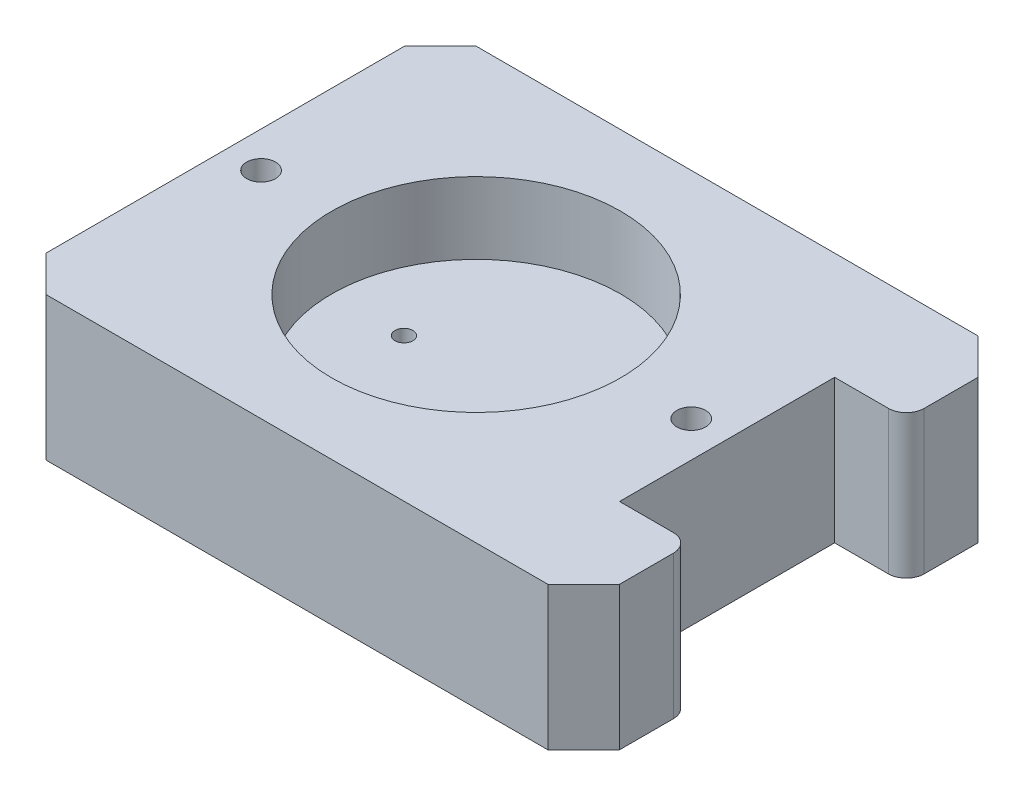
ISO-10303-21;
HEADER;
FILE_DESCRIPTION(('STEP AP214'),'2;1');
FILE_NAME('part.step','',(''),(''),'','','');
FILE_SCHEMA(('AUTOMOTIVE_DESIGN { 1 0 10303 214 1 1 1 1 }'));
ENDSEC;
DATA;
#1=APPLICATION_CONTEXT('core data for automotive mechanical design processes');
#2=APPLICATION_PROTOCOL_DEFINITION('international standard','automotive_design',2000,#1);
#3=PRODUCT_CONTEXT('',#1,'mechanical');
#4=PRODUCT('Part','Part','',(#3));
#5=PRODUCT_RELATED_PRODUCT_CATEGORY('part','',(#4));
#6=PRODUCT_DEFINITION_FORMATION('','',#4);
#7=PRODUCT_DEFINITION_CONTEXT('part definition',#1,'design');
#8=PRODUCT_DEFINITION('design','',#6,#7);
#9=PRODUCT_DEFINITION_SHAPE('','',#8);
#10=(LENGTH_UNIT() NAMED_UNIT(*) SI_UNIT(.MILLI.,.METRE.));
#11=(NAMED_UNIT(*) PLANE_ANGLE_UNIT() SI_UNIT($,.RADIAN.));
#12=(NAMED_UNIT(*) SI_UNIT($,.STERADIAN.) SOLID_ANGLE_UNIT());
#13=UNCERTAINTY_MEASURE_WITH_UNIT(LENGTH_MEASURE(1.E-05),#10,'distance_accuracy_value','');
#14=(GEOMETRIC_REPRESENTATION_CONTEXT(3) GLOBAL_UNCERTAINTY_ASSIGNED_CONTEXT((#13)) GLOBAL_UNIT_ASSIGNED_CONTEXT((#10,
#11,#12)) REPRESENTATION_CONTEXT('',''));
#15=CARTESIAN_POINT('',(0.,0.,0.));
#16=DIRECTION('',(0.,0.,1.));
#17=DIRECTION('',(1.,0.,0.));
#18=AXIS2_PLACEMENT_3D('',#15,#16,#17);
#19=CARTESIAN_POINT('',(50.8,25.4,19.05));
#20=DIRECTION('',(-1.,0.,0.));
#21=DIRECTION('',(0.,0.,1.));
#22=AXIS2_PLACEMENT_3D('',#19,#20,#21);
#23=PLANE('',#22);
#24=DIRECTION('',(0.,0.,-1.));
#25=VECTOR('',#24,1.);
#26=CARTESIAN_POINT('',(50.8,25.4,19.05));
#27=LINE('',#26,#25);
#28=CARTESIAN_POINT('',(50.8,25.4,31.75));
#29=VERTEX_POINT('',#28);
#30=CARTESIAN_POINT('',(50.8,25.4,22.225));
#31=VERTEX_POINT('',#30);
#32=EDGE_CURVE('E205',#29,#31,#27,.T.);
#33=ORIENTED_EDGE('',*,*,#32,.F.);
#34=DIRECTION('',(0.,-1.,0.));
#35=VECTOR('',#34,1.);
#36=CARTESIAN_POINT('',(50.8,25.4,31.75));
#37=LINE('',#36,#35);
#38=CARTESIAN_POINT('',(50.8,0.,31.75));
#39=VERTEX_POINT('',#38);
#40=EDGE_CURVE('E51',#29,#39,#37,.T.);
#41=ORIENTED_EDGE('',*,*,#40,.T.);
#42=DIRECTION('',(0.,0.,-1.));
#43=VECTOR('',#42,1.);
#44=CARTESIAN_POINT('',(50.8,0.,19.05));
#45=LINE('',#44,#43);
#46=CARTESIAN_POINT('',(50.8,0.,22.225));
#47=VERTEX_POINT('',#46);
#48=EDGE_CURVE('E201',#39,#47,#45,.T.);
#49=ORIENTED_EDGE('',*,*,#48,.T.);
#50=DIRECTION('',(0.,-1.,0.));
#51=VECTOR('',#50,1.);
#52=CARTESIAN_POINT('',(50.8,25.4,22.225));
#53=LINE('',#52,#51);
#54=EDGE_CURVE('E270',#47,#31,#53,.F.);
#55=ORIENTED_EDGE('',*,*,#54,.T.);
#56=EDGE_LOOP('',(#33,#41,#49,#55));
#57=FACE_BOUND('',#56,.T.);
#58=ADVANCED_FACE('F42',(#57),#23,.F.);
#59=CARTESIAN_POINT('',(50.8,25.4,19.05));
#60=DIRECTION('',(0.,0.,1.));
#61=DIRECTION('',(1.,0.,0.));
#62=AXIS2_PLACEMENT_3D('',#59,#60,#61);
#63=PLANE('',#62);
#64=DIRECTION('',(-1.,0.,0.));
#65=VECTOR('',#64,1.);
#66=CARTESIAN_POINT('',(50.8,25.4,19.05));
#67=LINE('',#66,#65);
#68=CARTESIAN_POINT('',(47.625,25.4,19.05));
#69=VERTEX_POINT('',#68);
#70=CARTESIAN_POINT('',(38.1,25.4,19.05));
#71=VERTEX_POINT('',#70);
#72=EDGE_CURVE('E207',#69,#71,#67,.T.);
#73=ORIENTED_EDGE('',*,*,#72,.F.);
#74=DIRECTION('',(0.,-1.,0.));
#75=VECTOR('',#74,1.);
#76=CARTESIAN_POINT('',(47.625,25.4,19.05));
#77=LINE('',#76,#75);
#78=CARTESIAN_POINT('',(47.625,0.,19.05));
#79=VERTEX_POINT('',#78);
#80=EDGE_CURVE('E261',#69,#79,#77,.T.);
#81=ORIENTED_EDGE('',*,*,#80,.T.);
#82=DIRECTION('',(-1.,0.,0.));
#83=VECTOR('',#82,1.);
#84=CARTESIAN_POINT('',(50.8,0.,19.05));
#85=LINE('',#84,#83);
#86=CARTESIAN_POINT('',(38.1,0.,19.05));
#87=VERTEX_POINT('',#86);
#88=EDGE_CURVE('E232',#79,#87,#85,.T.);
#89=ORIENTED_EDGE('',*,*,#88,.T.);
#90=DIRECTION('',(0.,-1.,0.));
#91=VECTOR('',#90,1.);
#92=CARTESIAN_POINT('',(38.1,25.4,19.05));
#93=LINE('',#92,#91);
#94=EDGE_CURVE('E257',#71,#87,#93,.T.);
#95=ORIENTED_EDGE('',*,*,#94,.F.);
#96=EDGE_LOOP('',(#73,#81,#89,#95));
#97=FACE_BOUND('',#96,.T.);
#98=ADVANCED_FACE('F341',(#97),#63,.F.);
#99=CARTESIAN_POINT('',(38.1,25.4,-19.05));
#100=DIRECTION('',(-1.,0.,0.));
#101=DIRECTION('',(0.,0.,1.));
#102=AXIS2_PLACEMENT_3D('',#99,#100,#101);
#103=PLANE('',#102);
#104=DIRECTION('',(0.,0.,-1.));
#105=VECTOR('',#104,1.);
#106=CARTESIAN_POINT('',(38.1,0.,-19.05));
#107=LINE('',#106,#105);
#108=CARTESIAN_POINT('',(38.1,0.,-19.05));
#109=VERTEX_POINT('',#108);
#110=EDGE_CURVE('E235',#87,#109,#107,.T.);
#111=ORIENTED_EDGE('',*,*,#110,.T.);
#112=DIRECTION('',(0.,-1.,0.));
#113=VECTOR('',#112,1.);
#114=CARTESIAN_POINT('',(38.1,25.4,-19.05));
#115=LINE('',#114,#113);
#116=CARTESIAN_POINT('',(38.1,25.4,-19.05));
#117=VERTEX_POINT('',#116);
#118=EDGE_CURVE('E229',#117,#109,#115,.T.);
#119=ORIENTED_EDGE('',*,*,#118,.F.);
#120=DIRECTION('',(0.,0.,-1.));
#121=VECTOR('',#120,1.);
#122=CARTESIAN_POINT('',(38.1,25.4,-19.05));
#123=LINE('',#122,#121);
#124=EDGE_CURVE('E210',#71,#117,#123,.T.);
#125=ORIENTED_EDGE('',*,*,#124,.F.);
#126=ORIENTED_EDGE('',*,*,#94,.T.);
#127=EDGE_LOOP('',(#111,#119,#125,#126));
#128=FACE_BOUND('',#127,.T.);
#129=ADVANCED_FACE('F345',(#128),#103,.F.);
#130=CARTESIAN_POINT('',(50.8,25.4,-19.05));
#131=DIRECTION('',(0.,0.,-1.));
#132=DIRECTION('',(-1.,0.,0.));
#133=AXIS2_PLACEMENT_3D('',#130,#131,#132);
#134=PLANE('',#133);
#135=DIRECTION('',(1.,0.,0.));
#136=VECTOR('',#135,1.);
#137=CARTESIAN_POINT('',(50.8,0.,-19.05));
#138=LINE('',#137,#136);
#139=CARTESIAN_POINT('',(47.625,0.,-19.05));
#140=VERTEX_POINT('',#139);
#141=EDGE_CURVE('E238',#109,#140,#138,.T.);
#142=ORIENTED_EDGE('',*,*,#141,.T.);
#143=DIRECTION('',(0.,-1.,0.));
#144=VECTOR('',#143,1.);
#145=CARTESIAN_POINT('',(47.625,25.4,-19.05));
#146=LINE('',#145,#144);
#147=CARTESIAN_POINT('',(47.625,25.4,-19.05));
#148=VERTEX_POINT('',#147);
#149=EDGE_CURVE('E280',#140,#148,#146,.F.);
#150=ORIENTED_EDGE('',*,*,#149,.T.);
#151=DIRECTION('',(1.,0.,0.));
#152=VECTOR('',#151,1.);
#153=CARTESIAN_POINT('',(50.8,25.4,-19.05));
#154=LINE('',#153,#152);
#155=EDGE_CURVE('E212',#117,#148,#154,.T.);
#156=ORIENTED_EDGE('',*,*,#155,.F.);
#157=ORIENTED_EDGE('',*,*,#118,.T.);
#158=EDGE_LOOP('',(#142,#150,#156,#157));
#159=FACE_BOUND('',#158,.T.);
#160=ADVANCED_FACE('F615',(#159),#134,.F.);
#161=CARTESIAN_POINT('',(50.8,25.4,-38.1));
#162=DIRECTION('',(-1.,0.,0.));
#163=DIRECTION('',(0.,0.,1.));
#164=AXIS2_PLACEMENT_3D('',#161,#162,#163);
#165=PLANE('',#164);
#166=DIRECTION('',(0.,0.,-1.));
#167=VECTOR('',#166,1.);
#168=CARTESIAN_POINT('',(50.8,0.,-38.1));
#169=LINE('',#168,#167);
#170=CARTESIAN_POINT('',(50.8,0.,-22.225));
#171=VERTEX_POINT('',#170);
#172=CARTESIAN_POINT('',(50.8,0.,-31.75));
#173=VERTEX_POINT('',#172);
#174=EDGE_CURVE('E241',#171,#173,#169,.T.);
#175=ORIENTED_EDGE('',*,*,#174,.T.);
#176=DIRECTION('',(0.,1.,0.));
#177=VECTOR('',#176,1.);
#178=CARTESIAN_POINT('',(50.8,25.4,-31.75));
#179=LINE('',#178,#177);
#180=CARTESIAN_POINT('',(50.8,25.4,-31.75));
#181=VERTEX_POINT('',#180);
#182=EDGE_CURVE('E11',#173,#181,#179,.T.);
#183=ORIENTED_EDGE('',*,*,#182,.T.);
#184=DIRECTION('',(0.,0.,-1.));
#185=VECTOR('',#184,1.);
#186=CARTESIAN_POINT('',(50.8,25.4,-38.1));
#187=LINE('',#186,#185);
#188=CARTESIAN_POINT('',(50.8,25.4,-22.225));
#189=VERTEX_POINT('',#188);
#190=EDGE_CURVE('E215',#189,#181,#187,.T.);
#191=ORIENTED_EDGE('',*,*,#190,.F.);
#192=DIRECTION('',(0.,-1.,0.));
#193=VECTOR('',#192,1.);
#194=CARTESIAN_POINT('',(50.8,25.4,-22.225));
#195=LINE('',#194,#193);
#196=EDGE_CURVE('E277',#189,#171,#195,.T.);
#197=ORIENTED_EDGE('',*,*,#196,.T.);
#198=EDGE_LOOP('',(#175,#183,#191,#197));
#199=FACE_BOUND('',#198,.T.);
#200=ADVANCED_FACE('F356',(#199),#165,.F.);
#201=CARTESIAN_POINT('',(-50.8,25.4,-38.1));
#202=DIRECTION('',(0.,0.,1.));
#203=DIRECTION('',(1.,0.,0.));
#204=AXIS2_PLACEMENT_3D('',#201,#202,#203);
#205=PLANE('',#204);
#206=DIRECTION('',(-1.,0.,0.));
#207=VECTOR('',#206,1.);
#208=CARTESIAN_POINT('',(-50.8,0.,-38.1));
#209=LINE('',#208,#207);
#210=CARTESIAN_POINT('',(44.45,0.,-38.1));
#211=VERTEX_POINT('',#210);
#212=CARTESIAN_POINT('',(-44.45,0.,-38.1));
#213=VERTEX_POINT('',#212);
#214=EDGE_CURVE('E244',#211,#213,#209,.T.);
#215=ORIENTED_EDGE('',*,*,#214,.T.);
#216=DIRECTION('',(0.,1.,0.));
#217=VECTOR('',#216,1.);
#218=CARTESIAN_POINT('',(-44.45,25.4,-38.1));
#219=LINE('',#218,#217);
#220=CARTESIAN_POINT('',(-44.45,25.4,-38.1));
#221=VERTEX_POINT('',#220);
#222=EDGE_CURVE('E316',#213,#221,#219,.T.);
#223=ORIENTED_EDGE('',*,*,#222,.T.);
#224=DIRECTION('',(-1.,0.,0.));
#225=VECTOR('',#224,1.);
#226=CARTESIAN_POINT('',(-50.8,25.4,-38.1));
#227=LINE('',#226,#225);
#228=CARTESIAN_POINT('',(44.45,25.4,-38.1));
#229=VERTEX_POINT('',#228);
#230=EDGE_CURVE('E218',#229,#221,#227,.T.);
#231=ORIENTED_EDGE('',*,*,#230,.F.);
#232=DIRECTION('',(0.,-1.,0.));
#233=VECTOR('',#232,1.);
#234=CARTESIAN_POINT('',(44.45,25.4,-38.1));
#235=LINE('',#234,#233);
#236=EDGE_CURVE('E313',#229,#211,#235,.T.);
#237=ORIENTED_EDGE('',*,*,#236,.T.);
#238=EDGE_LOOP('',(#215,#223,#231,#237));
#239=FACE_BOUND('',#238,.T.);
#240=ADVANCED_FACE('F365',(#239),#205,.F.);
#241=CARTESIAN_POINT('',(-50.8,25.4,-38.1));
#242=DIRECTION('',(1.,0.,0.));
#243=DIRECTION('',(0.,0.,-1.));
#244=AXIS2_PLACEMENT_3D('',#241,#242,#243);
#245=PLANE('',#244);
#246=CARTESIAN_POINT('',(-50.8,6.35,0.));
#247=DIRECTION('',(-1.,0.,0.));
#248=DIRECTION('',(0.,0.,1.));
#249=AXIS2_PLACEMENT_3D('',#246,#247,#248);
#250=CIRCLE('',#249,3.9679118);
#251=CARTESIAN_POINT('',(-50.8,6.35,3.96791179999996));
#252=VERTEX_POINT('',#251);
#253=EDGE_CURVE('E679',#252,#252,#250,.T.);
#254=ORIENTED_EDGE('',*,*,#253,.F.);
#255=EDGE_LOOP('',(#254));
#256=FACE_BOUND('',#255,.T.);
#257=DIRECTION('',(0.,0.,1.));
#258=VECTOR('',#257,1.);
#259=CARTESIAN_POINT('',(-50.8,0.,-38.1));
#260=LINE('',#259,#258);
#261=CARTESIAN_POINT('',(-50.8,0.,-31.75));
#262=VERTEX_POINT('',#261);
#263=CARTESIAN_POINT('',(-50.8,0.,31.75));
#264=VERTEX_POINT('',#263);
#265=EDGE_CURVE('E248',#262,#264,#260,.T.);
#266=ORIENTED_EDGE('',*,*,#265,.T.);
#267=DIRECTION('',(0.,1.,0.));
#268=VECTOR('',#267,1.);
#269=CARTESIAN_POINT('',(-50.8,25.4,31.75));
#270=LINE('',#269,#268);
#271=CARTESIAN_POINT('',(-50.8,25.4,31.75));
#272=VERTEX_POINT('',#271);
#273=EDGE_CURVE('E302',#264,#272,#270,.T.);
#274=ORIENTED_EDGE('',*,*,#273,.T.);
#275=DIRECTION('',(0.,0.,1.));
#276=VECTOR('',#275,1.);
#277=CARTESIAN_POINT('',(-50.8,25.4,-38.1));
#278=LINE('',#277,#276);
#279=CARTESIAN_POINT('',(-50.8,25.4,-31.75));
#280=VERTEX_POINT('',#279);
#281=EDGE_CURVE('E222',#280,#272,#278,.T.);
#282=ORIENTED_EDGE('',*,*,#281,.F.);
#283=DIRECTION('',(0.,-1.,0.));
#284=VECTOR('',#283,1.);
#285=CARTESIAN_POINT('',(-50.8,25.4,-31.75));
#286=LINE('',#285,#284);
#287=EDGE_CURVE('E299',#280,#262,#286,.T.);
#288=ORIENTED_EDGE('',*,*,#287,.T.);
#289=EDGE_LOOP('',(#266,#274,#282,#288));
#290=FACE_BOUND('',#289,.T.);
#291=ADVANCED_FACE('F374',(#256,#290),#245,.F.);
#292=CARTESIAN_POINT('',(-50.8,25.4,38.1));
#293=DIRECTION('',(0.,0.,-1.));
#294=DIRECTION('',(-1.,0.,0.));
#295=AXIS2_PLACEMENT_3D('',#292,#293,#294);
#296=PLANE('',#295);
#297=DIRECTION('',(1.,0.,0.));
#298=VECTOR('',#297,1.);
#299=CARTESIAN_POINT('',(-50.8,25.4,38.1));
#300=LINE('',#299,#298);
#301=CARTESIAN_POINT('',(-44.45,25.4,38.1));
#302=VERTEX_POINT('',#301);
#303=CARTESIAN_POINT('',(44.45,25.4,38.1));
#304=VERTEX_POINT('',#303);
#305=EDGE_CURVE('E225',#302,#304,#300,.T.);
#306=ORIENTED_EDGE('',*,*,#305,.F.);
#307=DIRECTION('',(0.,-1.,0.));
#308=VECTOR('',#307,1.);
#309=CARTESIAN_POINT('',(-44.45,25.4,38.1));
#310=LINE('',#309,#308);
#311=CARTESIAN_POINT('',(-44.45,0.,38.1));
#312=VERTEX_POINT('',#311);
#313=EDGE_CURVE('E285',#302,#312,#310,.T.);
#314=ORIENTED_EDGE('',*,*,#313,.T.);
#315=DIRECTION('',(1.,0.,0.));
#316=VECTOR('',#315,1.);
#317=CARTESIAN_POINT('',(-50.8,0.,38.1));
#318=LINE('',#317,#316);
#319=CARTESIAN_POINT('',(44.45,0.,38.1));
#320=VERTEX_POINT('',#319);
#321=EDGE_CURVE('E208',#312,#320,#318,.T.);
#322=ORIENTED_EDGE('',*,*,#321,.T.);
#323=DIRECTION('',(0.,1.,0.));
#324=VECTOR('',#323,1.);
#325=CARTESIAN_POINT('',(44.45,25.4,38.1));
#326=LINE('',#325,#324);
#327=EDGE_CURVE('E282',#320,#304,#326,.T.);
#328=ORIENTED_EDGE('',*,*,#327,.T.);
#329=EDGE_LOOP('',(#306,#314,#322,#328));
#330=FACE_BOUND('',#329,.T.);
#331=ADVANCED_FACE('F382',(#330),#296,.F.);
#332=CARTESIAN_POINT('',(0.,25.4,0.));
#333=DIRECTION('',(0.,1.,0.));
#334=DIRECTION('',(0.,0.,1.));
#335=AXIS2_PLACEMENT_3D('',#332,#333,#334);
#336=PLANE('',#335);
#337=CARTESIAN_POINT('',(-44.45,25.4,0.));
#338=DIRECTION('',(0.,1.,0.));
#339=DIRECTION('',(0.,0.,1.));
#340=AXIS2_PLACEMENT_3D('',#337,#338,#339);
#341=CIRCLE('',#340,2.55269999999999);
#342=CARTESIAN_POINT('',(-44.45,25.4,2.55269999999995));
#343=VERTEX_POINT('',#342);
#344=EDGE_CURVE('E183',#343,#343,#341,.T.);
#345=ORIENTED_EDGE('',*,*,#344,.F.);
#346=EDGE_LOOP('',(#345));
#347=FACE_BOUND('',#346,.T.);
#348=CARTESIAN_POINT('',(31.75,25.4,0.));
#349=DIRECTION('',(0.,1.,0.));
#350=DIRECTION('',(0.,0.,1.));
#351=AXIS2_PLACEMENT_3D('',#348,#349,#350);
#352=CIRCLE('',#351,2.55269999999999);
#353=CARTESIAN_POINT('',(31.75,25.4,2.5527));
#354=VERTEX_POINT('',#353);
#355=EDGE_CURVE('E189',#354,#354,#352,.T.);
#356=ORIENTED_EDGE('',*,*,#355,.F.);
#357=EDGE_LOOP('',(#356));
#358=FACE_BOUND('',#357,.T.);
#359=CARTESIAN_POINT('',(-6.35,25.4,0.));
#360=DIRECTION('',(0.,1.,0.));
#361=DIRECTION('',(0.,0.,1.));
#362=AXIS2_PLACEMENT_3D('',#359,#360,#361);
#363=CIRCLE('',#362,25.5905);
#364=CARTESIAN_POINT('',(-6.35,25.4,25.5905));
#365=VERTEX_POINT('',#364);
#366=EDGE_CURVE('E196',#365,#365,#363,.T.);
#367=ORIENTED_EDGE('',*,*,#366,.F.);
#368=EDGE_LOOP('',(#367));
#369=FACE_BOUND('',#368,.T.);
#370=ORIENTED_EDGE('',*,*,#281,.T.);
#371=DIRECTION('',(-0.707106781186546,0.,-0.707106781186549));
#372=VECTOR('',#371,1.);
#373=CARTESIAN_POINT('',(-41.2750000000001,25.4,41.2749999999999));
#374=LINE('',#373,#372);
#375=EDGE_CURVE('E310',#272,#302,#374,.F.);
#376=ORIENTED_EDGE('',*,*,#375,.T.);
#377=ORIENTED_EDGE('',*,*,#305,.T.);
#378=DIRECTION('',(-0.70710678118655,0.,0.707106781186545));
#379=VECTOR('',#378,1.);
#380=CARTESIAN_POINT('',(41.2749999999999,25.4,41.2750000000001));
#381=LINE('',#380,#379);
#382=EDGE_CURVE('E306',#304,#29,#381,.F.);
#383=ORIENTED_EDGE('',*,*,#382,.T.);
#384=ORIENTED_EDGE('',*,*,#32,.T.);
#385=CARTESIAN_POINT('',(47.625,25.4,22.225));
#386=DIRECTION('',(0.,1.,0.));
#387=DIRECTION('',(0.,0.,1.));
#388=AXIS2_PLACEMENT_3D('',#385,#386,#387);
#389=CIRCLE('',#388,3.175);
#390=EDGE_CURVE('E275',#31,#69,#389,.T.);
#391=ORIENTED_EDGE('',*,*,#390,.T.);
#392=ORIENTED_EDGE('',*,*,#72,.T.);
#393=ORIENTED_EDGE('',*,*,#124,.T.);
#394=ORIENTED_EDGE('',*,*,#155,.T.);
#395=CARTESIAN_POINT('',(47.625,25.4,-22.225));
#396=DIRECTION('',(0.,1.,0.));
#397=DIRECTION('',(0.,0.,1.));
#398=AXIS2_PLACEMENT_3D('',#395,#396,#397);
#399=CIRCLE('',#398,3.175);
#400=EDGE_CURVE('E273',#148,#189,#399,.T.);
#401=ORIENTED_EDGE('',*,*,#400,.T.);
#402=ORIENTED_EDGE('',*,*,#190,.T.);
#403=DIRECTION('',(0.707106781186545,0.,0.70710678118655));
#404=VECTOR('',#403,1.);
#405=CARTESIAN_POINT('',(41.2750000000002,25.4,-41.2749999999999));
#406=LINE('',#405,#404);
#407=EDGE_CURVE('E304',#181,#229,#406,.F.);
#408=ORIENTED_EDGE('',*,*,#407,.T.);
#409=ORIENTED_EDGE('',*,*,#230,.T.);
#410=DIRECTION('',(0.70710678118655,0.,-0.707106781186545));
#411=VECTOR('',#410,1.);
#412=CARTESIAN_POINT('',(-41.2749999999999,25.4,-41.2750000000001));
#413=LINE('',#412,#411);
#414=EDGE_CURVE('E308',#221,#280,#413,.F.);
#415=ORIENTED_EDGE('',*,*,#414,.T.);
#416=EDGE_LOOP('',(#370,#376,#377,#383,#384,#391,#392,#393,#394,#401,#402,#408,#409,#415));
#417=FACE_BOUND('',#416,.T.);
#418=ADVANCED_FACE('F338',(#347,#358,#369,#417),#336,.T.);
#419=CARTESIAN_POINT('',(0.,0.,0.));
#420=DIRECTION('',(0.,1.,0.));
#421=DIRECTION('',(0.,0.,1.));
#422=AXIS2_PLACEMENT_3D('',#419,#420,#421);
#423=PLANE('',#422);
#424=ORIENTED_EDGE('',*,*,#321,.F.);
#425=DIRECTION('',(0.707106781186546,0.,0.707106781186549));
#426=VECTOR('',#425,1.);
#427=CARTESIAN_POINT('',(-44.45,0.,38.1));
#428=LINE('',#427,#426);
#429=EDGE_CURVE('E296',#312,#264,#428,.F.);
#430=ORIENTED_EDGE('',*,*,#429,.T.);
#431=ORIENTED_EDGE('',*,*,#265,.F.);
#432=DIRECTION('',(-0.70710678118655,0.,0.707106781186545));
#433=VECTOR('',#432,1.);
#434=CARTESIAN_POINT('',(-50.8,0.,-31.75));
#435=LINE('',#434,#433);
#436=EDGE_CURVE('E294',#262,#213,#435,.F.);
#437=ORIENTED_EDGE('',*,*,#436,.T.);
#438=ORIENTED_EDGE('',*,*,#214,.F.);
#439=DIRECTION('',(-0.707106781186545,0.,-0.70710678118655));
#440=VECTOR('',#439,1.);
#441=CARTESIAN_POINT('',(44.45,0.,-38.1));
#442=LINE('',#441,#440);
#443=EDGE_CURVE('E289',#211,#173,#442,.F.);
#444=ORIENTED_EDGE('',*,*,#443,.T.);
#445=ORIENTED_EDGE('',*,*,#174,.F.);
#446=CARTESIAN_POINT('',(47.625,0.,-22.225));
#447=DIRECTION('',(0.,1.,0.));
#448=DIRECTION('',(0.,0.,1.));
#449=AXIS2_PLACEMENT_3D('',#446,#447,#448);
#450=CIRCLE('',#449,3.175);
#451=EDGE_CURVE('E265',#171,#140,#450,.F.);
#452=ORIENTED_EDGE('',*,*,#451,.T.);
#453=ORIENTED_EDGE('',*,*,#141,.F.);
#454=ORIENTED_EDGE('',*,*,#110,.F.);
#455=ORIENTED_EDGE('',*,*,#88,.F.);
#456=CARTESIAN_POINT('',(47.625,0.,22.225));
#457=DIRECTION('',(0.,1.,0.));
#458=DIRECTION('',(0.,0.,1.));
#459=AXIS2_PLACEMENT_3D('',#456,#457,#458);
#460=CIRCLE('',#459,3.175);
#461=EDGE_CURVE('E267',#79,#47,#460,.F.);
#462=ORIENTED_EDGE('',*,*,#461,.T.);
#463=ORIENTED_EDGE('',*,*,#48,.F.);
#464=DIRECTION('',(0.70710678118655,0.,-0.707106781186545));
#465=VECTOR('',#464,1.);
#466=CARTESIAN_POINT('',(50.8,0.,31.75));
#467=LINE('',#466,#465);
#468=EDGE_CURVE('E291',#39,#320,#467,.F.);
#469=ORIENTED_EDGE('',*,*,#468,.T.);
#470=EDGE_LOOP('',(#424,#430,#431,#437,#438,#444,#445,#452,#453,#454,#455,#462,#463,#469));
#471=FACE_BOUND('',#470,.T.);
#472=ADVANCED_FACE('F328',(#471),#423,.F.);
#473=CARTESIAN_POINT('',(-6.35,12.7,0.));
#474=DIRECTION('',(0.,1.,0.));
#475=DIRECTION('',(0.,0.,1.));
#476=AXIS2_PLACEMENT_3D('',#473,#474,#475);
#477=CYLINDRICAL_SURFACE('',#476,25.5905);
#478=CARTESIAN_POINT('',(-6.35,12.7,0.));
#479=DIRECTION('',(0.,1.,0.));
#480=DIRECTION('',(0.,0.,1.));
#481=AXIS2_PLACEMENT_3D('',#478,#479,#480);
#482=CIRCLE('',#481,25.5905);
#483=CARTESIAN_POINT('',(-6.35,12.7,25.5905));
#484=VERTEX_POINT('',#483);
#485=EDGE_CURVE('E197',#484,#484,#482,.T.);
#486=ORIENTED_EDGE('',*,*,#485,.F.);
#487=EDGE_LOOP('',(#486));
#488=FACE_BOUND('',#487,.T.);
#489=ORIENTED_EDGE('',*,*,#366,.T.);
#490=EDGE_LOOP('',(#489));
#491=FACE_BOUND('',#490,.T.);
#492=ADVANCED_FACE('F507',(#488,#491),#477,.F.);
#493=CARTESIAN_POINT('',(-6.35,12.7,0.));
#494=DIRECTION('',(0.,1.,0.));
#495=DIRECTION('',(0.,0.,1.));
#496=AXIS2_PLACEMENT_3D('',#493,#494,#495);
#497=PLANE('',#496);
#498=CARTESIAN_POINT('',(-19.14525,12.7,0.));
#499=DIRECTION('',(0.,1.,0.));
#500=DIRECTION('',(0.,0.,1.));
#501=AXIS2_PLACEMENT_3D('',#498,#499,#500);
#502=CIRCLE('',#501,1.5875);
#503=CARTESIAN_POINT('',(-19.14525,12.7,1.5875));
#504=VERTEX_POINT('',#503);
#505=EDGE_CURVE('E170',#504,#504,#502,.T.);
#506=ORIENTED_EDGE('',*,*,#505,.F.);
#507=EDGE_LOOP('',(#506));
#508=FACE_BOUND('',#507,.T.);
#509=CARTESIAN_POINT('',(6.44525000000001,12.7,0.));
#510=DIRECTION('',(0.,1.,0.));
#511=DIRECTION('',(0.,0.,1.));
#512=AXIS2_PLACEMENT_3D('',#509,#510,#511);
#513=CIRCLE('',#512,1.5875);
#514=CARTESIAN_POINT('',(6.44525000000001,12.7,1.5875));
#515=VERTEX_POINT('',#514);
#516=EDGE_CURVE('E176',#515,#515,#513,.T.);
#517=ORIENTED_EDGE('',*,*,#516,.F.);
#518=EDGE_LOOP('',(#517));
#519=FACE_BOUND('',#518,.T.);
#520=ORIENTED_EDGE('',*,*,#485,.T.);
#521=EDGE_LOOP('',(#520));
#522=FACE_BOUND('',#521,.T.);
#523=ADVANCED_FACE('F402',(#508,#519,#522),#497,.T.);
#524=CARTESIAN_POINT('',(47.625,25.4,22.225));
#525=DIRECTION('',(0.,-1.,0.));
#526=DIRECTION('',(0.,0.,-1.));
#527=AXIS2_PLACEMENT_3D('',#524,#525,#526);
#528=CYLINDRICAL_SURFACE('',#527,3.175);
#529=ORIENTED_EDGE('',*,*,#390,.F.);
#530=ORIENTED_EDGE('',*,*,#54,.F.);
#531=ORIENTED_EDGE('',*,*,#461,.F.);
#532=ORIENTED_EDGE('',*,*,#80,.F.);
#533=EDGE_LOOP('',(#529,#530,#531,#532));
#534=FACE_BOUND('',#533,.T.);
#535=ADVANCED_FACE('F335',(#534),#528,.T.);
#536=CARTESIAN_POINT('',(47.625,25.4,-22.225));
#537=DIRECTION('',(0.,-1.,0.));
#538=DIRECTION('',(0.,0.,-1.));
#539=AXIS2_PLACEMENT_3D('',#536,#537,#538);
#540=CYLINDRICAL_SURFACE('',#539,3.175);
#541=ORIENTED_EDGE('',*,*,#400,.F.);
#542=ORIENTED_EDGE('',*,*,#149,.F.);
#543=ORIENTED_EDGE('',*,*,#451,.F.);
#544=ORIENTED_EDGE('',*,*,#196,.F.);
#545=EDGE_LOOP('',(#541,#542,#543,#544));
#546=FACE_BOUND('',#545,.T.);
#547=ADVANCED_FACE('F353',(#546),#540,.T.);
#548=CARTESIAN_POINT('',(-44.45,25.4,38.1));
#549=DIRECTION('',(0.707106781186549,0.,-0.707106781186546));
#550=DIRECTION('',(0.,-1.,0.));
#551=AXIS2_PLACEMENT_3D('',#548,#549,#550);
#552=PLANE('',#551);
#553=ORIENTED_EDGE('',*,*,#375,.F.);
#554=ORIENTED_EDGE('',*,*,#273,.F.);
#555=ORIENTED_EDGE('',*,*,#429,.F.);
#556=ORIENTED_EDGE('',*,*,#313,.F.);
#557=EDGE_LOOP('',(#553,#554,#555,#556));
#558=FACE_BOUND('',#557,.T.);
#559=ADVANCED_FACE('F379',(#558),#552,.F.);
#560=CARTESIAN_POINT('',(-50.8,25.4,-31.75));
#561=DIRECTION('',(0.707106781186545,0.,0.70710678118655));
#562=DIRECTION('',(0.,-1.,0.));
#563=AXIS2_PLACEMENT_3D('',#560,#561,#562);
#564=PLANE('',#563);
#565=ORIENTED_EDGE('',*,*,#414,.F.);
#566=ORIENTED_EDGE('',*,*,#222,.F.);
#567=ORIENTED_EDGE('',*,*,#436,.F.);
#568=ORIENTED_EDGE('',*,*,#287,.F.);
#569=EDGE_LOOP('',(#565,#566,#567,#568));
#570=FACE_BOUND('',#569,.T.);
#571=ADVANCED_FACE('F371',(#570),#564,.F.);
#572=CARTESIAN_POINT('',(50.8,25.4,31.75));
#573=DIRECTION('',(-0.707106781186545,0.,-0.70710678118655));
#574=DIRECTION('',(0.,-1.,0.));
#575=AXIS2_PLACEMENT_3D('',#572,#573,#574);
#576=PLANE('',#575);
#577=ORIENTED_EDGE('',*,*,#382,.F.);
#578=ORIENTED_EDGE('',*,*,#327,.F.);
#579=ORIENTED_EDGE('',*,*,#468,.F.);
#580=ORIENTED_EDGE('',*,*,#40,.F.);
#581=EDGE_LOOP('',(#577,#578,#579,#580));
#582=FACE_BOUND('',#581,.T.);
#583=ADVANCED_FACE('F384',(#582),#576,.F.);
#584=CARTESIAN_POINT('',(44.45,25.4,-38.1));
#585=DIRECTION('',(-0.70710678118655,0.,0.707106781186545));
#586=DIRECTION('',(0.,-1.,0.));
#587=AXIS2_PLACEMENT_3D('',#584,#585,#586);
#588=PLANE('',#587);
#589=ORIENTED_EDGE('',*,*,#407,.F.);
#590=ORIENTED_EDGE('',*,*,#182,.F.);
#591=ORIENTED_EDGE('',*,*,#443,.F.);
#592=ORIENTED_EDGE('',*,*,#236,.F.);
#593=EDGE_LOOP('',(#589,#590,#591,#592));
#594=FACE_BOUND('',#593,.T.);
#595=ADVANCED_FACE('F44',(#594),#588,.F.);
#596=CARTESIAN_POINT('',(31.75,12.7,0.));
#597=DIRECTION('',(0.,1.,0.));
#598=DIRECTION('',(0.,0.,1.));
#599=AXIS2_PLACEMENT_3D('',#596,#597,#598);
#600=CONICAL_SURFACE('',#599,2.5527,1.02974425867665);
#601=CARTESIAN_POINT('',(31.75,11.1661830978083,0.));
#602=VERTEX_POINT('',#601);
#603=VERTEX_LOOP('',#602);
#604=FACE_BOUND('',#603,.T.);
#605=CARTESIAN_POINT('',(31.75,12.7,0.));
#606=DIRECTION('',(0.,1.,0.));
#607=DIRECTION('',(0.,0.,1.));
#608=AXIS2_PLACEMENT_3D('',#605,#606,#607);
#609=CIRCLE('',#608,2.5527);
#610=CARTESIAN_POINT('',(31.75,12.7,2.55270000000001));
#611=VERTEX_POINT('',#610);
#612=EDGE_CURVE('E192',#611,#611,#609,.T.);
#613=ORIENTED_EDGE('',*,*,#612,.T.);
#614=EDGE_LOOP('',(#613));
#615=FACE_BOUND('',#614,.T.);
#616=ADVANCED_FACE('F390',(#604,#615),#600,.F.);
#617=CARTESIAN_POINT('',(31.75,25.4,0.));
#618=DIRECTION('',(0.,1.,0.));
#619=DIRECTION('',(0.,0.,1.));
#620=AXIS2_PLACEMENT_3D('',#617,#618,#619);
#621=CYLINDRICAL_SURFACE('',#620,2.55269999999999);
#622=ORIENTED_EDGE('',*,*,#612,.F.);
#623=EDGE_LOOP('',(#622));
#624=FACE_BOUND('',#623,.T.);
#625=ORIENTED_EDGE('',*,*,#355,.T.);
#626=EDGE_LOOP('',(#625));
#627=FACE_BOUND('',#626,.T.);
#628=ADVANCED_FACE('F450',(#624,#627),#621,.F.);
#629=CARTESIAN_POINT('',(-44.45,12.7,0.));
#630=DIRECTION('',(0.,1.,0.));
#631=DIRECTION('',(0.,0.,1.));
#632=AXIS2_PLACEMENT_3D('',#629,#630,#631);
#633=CONICAL_SURFACE('',#632,2.5527,1.02974425867665);
#634=CARTESIAN_POINT('',(-44.45,11.1661830978083,0.));
#635=VERTEX_POINT('',#634);
#636=VERTEX_LOOP('',#635);
#637=FACE_BOUND('',#636,.T.);
#638=CARTESIAN_POINT('',(-44.45,12.7,0.));
#639=DIRECTION('',(0.,1.,0.));
#640=DIRECTION('',(0.,0.,1.));
#641=AXIS2_PLACEMENT_3D('',#638,#639,#640);
#642=CIRCLE('',#641,2.5527);
#643=CARTESIAN_POINT('',(-44.45,12.7,2.55269999999996));
#644=VERTEX_POINT('',#643);
#645=EDGE_CURVE('E186',#644,#644,#642,.T.);
#646=ORIENTED_EDGE('',*,*,#645,.T.);
#647=EDGE_LOOP('',(#646));
#648=FACE_BOUND('',#647,.T.);
#649=ADVANCED_FACE('F461',(#637,#648),#633,.F.);
#650=CARTESIAN_POINT('',(-44.45,25.4,0.));
#651=DIRECTION('',(0.,1.,0.));
#652=DIRECTION('',(0.,0.,1.));
#653=AXIS2_PLACEMENT_3D('',#650,#651,#652);
#654=CYLINDRICAL_SURFACE('',#653,2.55269999999999);
#655=ORIENTED_EDGE('',*,*,#645,.F.);
#656=EDGE_LOOP('',(#655));
#657=FACE_BOUND('',#656,.T.);
#658=ORIENTED_EDGE('',*,*,#344,.T.);
#659=EDGE_LOOP('',(#658));
#660=FACE_BOUND('',#659,.T.);
#661=ADVANCED_FACE('F472',(#657,#660),#654,.F.);
#662=CARTESIAN_POINT('',(12.7,6.35,0.));
#663=DIRECTION('',(-1.,0.,0.));
#664=DIRECTION('',(0.,0.,1.));
#665=AXIS2_PLACEMENT_3D('',#662,#663,#664);
#666=CYLINDRICAL_SURFACE('',#665,1.5875);
#667=CARTESIAN_POINT('',(-38.2231812061869,6.35,0.));
#668=DIRECTION('',(-1.,0.,0.));
#669=DIRECTION('',(0.,0.,1.));
#670=AXIS2_PLACEMENT_3D('',#667,#668,#669);
#671=CIRCLE('',#670,1.5875);
#672=CARTESIAN_POINT('',(-38.2231812061869,6.35,1.58749999999996));
#673=VERTEX_POINT('',#672);
#674=EDGE_CURVE('E46',#673,#673,#671,.T.);
#675=ORIENTED_EDGE('',*,*,#674,.T.);
#676=EDGE_LOOP('',(#675));
#677=FACE_BOUND('',#676,.T.);
#678=CARTESIAN_POINT('',(-19.14525,6.35,0.));
#679=DIRECTION('',(0.707106781186547,0.707106781186547,0.));
#680=DIRECTION('',(-0.707106781186547,0.707106781186547,0.));
#681=AXIS2_PLACEMENT_3D('',#678,#679,#680);
#682=ELLIPSE('',#681,2.24506403026729,1.5875);
#683=CARTESIAN_POINT('',(-19.14525,6.35,1.58749999999998));
#684=VERTEX_POINT('',#683);
#685=CARTESIAN_POINT('',(-19.14525,6.35,-1.58750000000002));
#686=VERTEX_POINT('',#685);
#687=EDGE_CURVE('E163',#684,#686,#682,.F.);
#688=ORIENTED_EDGE('',*,*,#687,.F.);
#689=CARTESIAN_POINT('',(-19.14525,6.35,0.));
#690=DIRECTION('',(-0.707106781186547,0.707106781186547,0.));
#691=DIRECTION('',(0.707106781186547,0.707106781186547,0.));
#692=AXIS2_PLACEMENT_3D('',#689,#690,#691);
#693=ELLIPSE('',#692,2.24506403026729,1.5875);
#694=EDGE_CURVE('E57',#686,#684,#693,.F.);
#695=ORIENTED_EDGE('',*,*,#694,.F.);
#696=EDGE_LOOP('',(#688,#695));
#697=FACE_BOUND('',#696,.T.);
#698=CARTESIAN_POINT('',(6.44525000000001,6.35,0.));
#699=DIRECTION('',(0.707106781186547,0.707106781186547,0.));
#700=DIRECTION('',(-0.707106781186547,0.707106781186547,0.));
#701=AXIS2_PLACEMENT_3D('',#698,#699,#700);
#702=ELLIPSE('',#701,2.24506403026729,1.5875);
#703=CARTESIAN_POINT('',(6.44525000000001,6.35,1.58749999999998));
#704=VERTEX_POINT('',#703);
#705=CARTESIAN_POINT('',(6.44525000000001,6.35,-1.58750000000003));
#706=VERTEX_POINT('',#705);
#707=EDGE_CURVE('E166',#704,#706,#702,.F.);
#708=ORIENTED_EDGE('',*,*,#707,.F.);
#709=CARTESIAN_POINT('',(6.44525000000001,6.35,0.));
#710=DIRECTION('',(-0.707106781186547,0.707106781186547,0.));
#711=DIRECTION('',(0.707106781186547,0.707106781186547,0.));
#712=AXIS2_PLACEMENT_3D('',#709,#710,#711);
#713=ELLIPSE('',#712,2.24506403026729,1.5875);
#714=EDGE_CURVE('E64',#706,#704,#713,.F.);
#715=ORIENTED_EDGE('',*,*,#714,.F.);
#716=EDGE_LOOP('',(#708,#715));
#717=FACE_BOUND('',#716,.T.);
#718=CARTESIAN_POINT('',(12.7,6.35,0.));
#719=DIRECTION('',(-1.,0.,0.));
#720=DIRECTION('',(0.,0.,1.));
#721=AXIS2_PLACEMENT_3D('',#718,#719,#720);
#722=CIRCLE('',#721,1.5875);
#723=CARTESIAN_POINT('',(12.7,6.35,1.58749999999995));
#724=VERTEX_POINT('',#723);
#725=EDGE_CURVE('E180',#724,#724,#722,.T.);
#726=ORIENTED_EDGE('',*,*,#725,.F.);
#727=EDGE_LOOP('',(#726));
#728=FACE_BOUND('',#727,.T.);
#729=ADVANCED_FACE('F168',(#677,#697,#717,#728),#666,.F.);
#730=CARTESIAN_POINT('',(12.7,6.35,0.));
#731=DIRECTION('',(-1.,0.,0.));
#732=DIRECTION('',(0.,0.,1.));
#733=AXIS2_PLACEMENT_3D('',#730,#731,#732);
#734=PLANE('',#733);
#735=ORIENTED_EDGE('',*,*,#725,.T.);
#736=EDGE_LOOP('',(#735));
#737=FACE_BOUND('',#736,.T.);
#738=ADVANCED_FACE('F488',(#737),#734,.T.);
#739=CARTESIAN_POINT('',(6.44525000000001,-0.000999999999999265,0.));
#740=DIRECTION('',(0.,1.,0.));
#741=DIRECTION('',(0.,0.,1.));
#742=AXIS2_PLACEMENT_3D('',#739,#740,#741);
#743=CYLINDRICAL_SURFACE('',#742,1.5875);
#744=ORIENTED_EDGE('',*,*,#516,.T.);
#745=EDGE_LOOP('',(#744));
#746=FACE_BOUND('',#745,.T.);
#747=ORIENTED_EDGE('',*,*,#714,.T.);
#748=ORIENTED_EDGE('',*,*,#707,.T.);
#749=EDGE_LOOP('',(#747,#748));
#750=FACE_BOUND('',#749,.T.);
#751=ADVANCED_FACE('F493',(#746,#750),#743,.F.);
#752=CARTESIAN_POINT('',(-19.14525,-0.000999999999999265,0.));
#753=DIRECTION('',(0.,1.,0.));
#754=DIRECTION('',(0.,0.,1.));
#755=AXIS2_PLACEMENT_3D('',#752,#753,#754);
#756=CYLINDRICAL_SURFACE('',#755,1.5875);
#757=ORIENTED_EDGE('',*,*,#505,.T.);
#758=EDGE_LOOP('',(#757));
#759=FACE_BOUND('',#758,.T.);
#760=ORIENTED_EDGE('',*,*,#694,.T.);
#761=ORIENTED_EDGE('',*,*,#687,.T.);
#762=EDGE_LOOP('',(#760,#761));
#763=FACE_BOUND('',#762,.T.);
#764=ADVANCED_FACE('F164',(#759,#763),#756,.F.);
#765=CARTESIAN_POINT('',(-39.116,6.35,0.));
#766=DIRECTION('',(-1.,0.,0.));
#767=DIRECTION('',(0.,0.,1.));
#768=AXIS2_PLACEMENT_3D('',#765,#766,#767);
#769=CONICAL_SURFACE('',#768,3.07340000000001,1.02974425867665);
#770=CARTESIAN_POINT('',(-39.116,6.35,0.));
#771=DIRECTION('',(-1.,0.,0.));
#772=DIRECTION('',(0.,0.,1.));
#773=AXIS2_PLACEMENT_3D('',#770,#771,#772);
#774=CIRCLE('',#773,3.07340000000001);
#775=CARTESIAN_POINT('',(-39.116,6.35,3.07339999999997));
#776=VERTEX_POINT('',#775);
#777=EDGE_CURVE('E689',#776,#776,#774,.T.);
#778=ORIENTED_EDGE('',*,*,#777,.T.);
#779=EDGE_LOOP('',(#778));
#780=FACE_BOUND('',#779,.T.);
#781=ORIENTED_EDGE('',*,*,#674,.F.);
#782=EDGE_LOOP('',(#781));
#783=FACE_BOUND('',#782,.T.);
#784=ADVANCED_FACE('F526',(#780,#783),#769,.F.);
#785=CARTESIAN_POINT('',(-50.8,6.35,0.));
#786=DIRECTION('',(-1.,0.,0.));
#787=DIRECTION('',(0.,0.,1.));
#788=AXIS2_PLACEMENT_3D('',#785,#786,#787);
#789=CYLINDRICAL_SURFACE('',#788,3.07340000000001);
#790=ORIENTED_EDGE('',*,*,#777,.F.);
#791=EDGE_LOOP('',(#790));
#792=FACE_BOUND('',#791,.T.);
#793=CARTESIAN_POINT('',(-43.942,6.35,0.));
#794=DIRECTION('',(-1.,0.,0.));
#795=DIRECTION('',(0.,0.,1.));
#796=AXIS2_PLACEMENT_3D('',#793,#794,#795);
#797=CIRCLE('',#796,3.07340000000001);
#798=CARTESIAN_POINT('',(-43.942,6.35,3.07339999999997));
#799=VERTEX_POINT('',#798);
#800=EDGE_CURVE('E683',#799,#799,#797,.T.);
#801=ORIENTED_EDGE('',*,*,#800,.T.);
#802=EDGE_LOOP('',(#801));
#803=FACE_BOUND('',#802,.T.);
#804=ADVANCED_FACE('F553',(#792,#803),#789,.F.);
#805=CARTESIAN_POINT('',(-43.942,9.42340000000001,0.));
#806=DIRECTION('',(1.,0.,0.));
#807=DIRECTION('',(0.,0.,-1.));
#808=AXIS2_PLACEMENT_3D('',#805,#806,#807);
#809=PLANE('',#808);
#810=ORIENTED_EDGE('',*,*,#800,.F.);
#811=EDGE_LOOP('',(#810));
#812=FACE_BOUND('',#811,.T.);
#813=CARTESIAN_POINT('',(-43.942,6.35,0.));
#814=DIRECTION('',(-1.,0.,0.));
#815=DIRECTION('',(0.,0.,1.));
#816=AXIS2_PLACEMENT_3D('',#813,#814,#815);
#817=CIRCLE('',#816,3.7625740959685);
#818=CARTESIAN_POINT('',(-43.942,6.35,3.76257409596846));
#819=VERTEX_POINT('',#818);
#820=EDGE_CURVE('E676',#819,#819,#817,.T.);
#821=ORIENTED_EDGE('',*,*,#820,.T.);
#822=EDGE_LOOP('',(#821));
#823=FACE_BOUND('',#822,.T.);
#824=ADVANCED_FACE('F563',(#812,#823),#809,.F.);
#825=CARTESIAN_POINT('',(-50.8,6.35,0.));
#826=DIRECTION('',(-1.,0.,0.));
#827=DIRECTION('',(0.,0.,1.));
#828=AXIS2_PLACEMENT_3D('',#825,#826,#827);
#829=CONICAL_SURFACE('',#828,3.9679118,0.0299323966717023);
#830=ORIENTED_EDGE('',*,*,#820,.F.);
#831=EDGE_LOOP('',(#830));
#832=FACE_BOUND('',#831,.T.);
#833=ORIENTED_EDGE('',*,*,#253,.T.);
#834=EDGE_LOOP('',(#833));
#835=FACE_BOUND('',#834,.T.);
#836=ADVANCED_FACE('F573',(#832,#835),#829,.F.);
#837=CLOSED_SHELL('',(#58,#98,#129,#160,#200,#240,#291,#331,#418,#472,#492,#523,#535,#547,#559,
#571,#583,#595,#616,#628,#649,#661,#729,#738,#751,#764,#784,#804,#824,#836));
#838=MANIFOLD_SOLID_BREP('B2',#837);
#839=ADVANCED_BREP_SHAPE_REPRESENTATION('',(#18,#838),#14);
#840=SHAPE_DEFINITION_REPRESENTATION(#9,#839);
ENDSEC;
END-ISO-10303-21;
